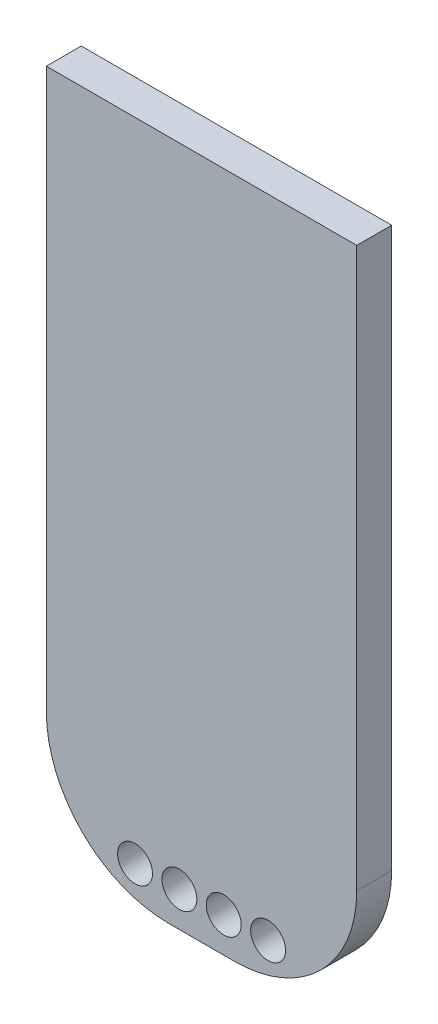
ISO-10303-21;
HEADER;
FILE_DESCRIPTION(('STEP AP214'),'2;1');
FILE_NAME('part.step','',(''),(''),'','','');
FILE_SCHEMA(('AUTOMOTIVE_DESIGN { 1 0 10303 214 1 1 1 1 }'));
ENDSEC;
DATA;
#1=APPLICATION_CONTEXT('core data for automotive mechanical design processes');
#2=APPLICATION_PROTOCOL_DEFINITION('international standard','automotive_design',2000,#1);
#3=PRODUCT_CONTEXT('',#1,'mechanical');
#4=PRODUCT('Part','Part','',(#3));
#5=PRODUCT_RELATED_PRODUCT_CATEGORY('part','',(#4));
#6=PRODUCT_DEFINITION_FORMATION('','',#4);
#7=PRODUCT_DEFINITION_CONTEXT('part definition',#1,'design');
#8=PRODUCT_DEFINITION('design','',#6,#7);
#9=PRODUCT_DEFINITION_SHAPE('','',#8);
#10=(LENGTH_UNIT() NAMED_UNIT(*) SI_UNIT(.MILLI.,.METRE.));
#11=(NAMED_UNIT(*) PLANE_ANGLE_UNIT() SI_UNIT($,.RADIAN.));
#12=(NAMED_UNIT(*) SI_UNIT($,.STERADIAN.) SOLID_ANGLE_UNIT());
#13=UNCERTAINTY_MEASURE_WITH_UNIT(LENGTH_MEASURE(1.E-05),#10,'distance_accuracy_value','');
#14=(GEOMETRIC_REPRESENTATION_CONTEXT(3) GLOBAL_UNCERTAINTY_ASSIGNED_CONTEXT((#13)) GLOBAL_UNIT_ASSIGNED_CONTEXT((#10,
#11,#12)) REPRESENTATION_CONTEXT('',''));
#15=CARTESIAN_POINT('',(0.,0.,0.));
#16=DIRECTION('',(0.,0.,1.));
#17=DIRECTION('',(1.,0.,0.));
#18=AXIS2_PLACEMENT_3D('',#15,#16,#17);
#19=CARTESIAN_POINT('',(0.,39.02,2.));
#20=DIRECTION('',(1.,0.,0.));
#21=DIRECTION('',(0.,1.,0.));
#22=AXIS2_PLACEMENT_3D('',#19,#20,#21);
#23=PLANE('',#22);
#24=DIRECTION('',(0.,-1.,0.));
#25=VECTOR('',#24,1.);
#26=CARTESIAN_POINT('',(0.,39.02,0.));
#27=LINE('',#26,#25);
#28=CARTESIAN_POINT('',(0.,39.02,0.));
#29=VERTEX_POINT('',#28);
#30=CARTESIAN_POINT('',(0.,7.,0.));
#31=VERTEX_POINT('',#30);
#32=EDGE_CURVE('E114',#29,#31,#27,.T.);
#33=ORIENTED_EDGE('',*,*,#32,.T.);
#34=DIRECTION('',(0.,0.,-1.));
#35=VECTOR('',#34,1.);
#36=CARTESIAN_POINT('',(0.,7.,2.));
#37=LINE('',#36,#35);
#38=CARTESIAN_POINT('',(0.,7.,2.));
#39=VERTEX_POINT('',#38);
#40=EDGE_CURVE('E11',#31,#39,#37,.F.);
#41=ORIENTED_EDGE('',*,*,#40,.T.);
#42=DIRECTION('',(0.,-1.,0.));
#43=VECTOR('',#42,1.);
#44=CARTESIAN_POINT('',(0.,39.02,2.));
#45=LINE('',#44,#43);
#46=CARTESIAN_POINT('',(0.,39.02,2.));
#47=VERTEX_POINT('',#46);
#48=EDGE_CURVE('E121',#47,#39,#45,.T.);
#49=ORIENTED_EDGE('',*,*,#48,.F.);
#50=DIRECTION('',(0.,0.,-1.));
#51=VECTOR('',#50,1.);
#52=CARTESIAN_POINT('',(0.,39.02,2.));
#53=LINE('',#52,#51);
#54=EDGE_CURVE('E106',#47,#29,#53,.T.);
#55=ORIENTED_EDGE('',*,*,#54,.T.);
#56=EDGE_LOOP('',(#33,#41,#49,#55));
#57=FACE_BOUND('',#56,.T.);
#58=ADVANCED_FACE('F32',(#57),#23,.F.);
#59=CARTESIAN_POINT('',(0.,0.,2.));
#60=DIRECTION('',(0.,1.,0.));
#61=DIRECTION('',(0.,0.,1.));
#62=AXIS2_PLACEMENT_3D('',#59,#60,#61);
#63=PLANE('',#62);
#64=DIRECTION('',(1.,0.,0.));
#65=VECTOR('',#64,1.);
#66=CARTESIAN_POINT('',(0.,0.,0.));
#67=LINE('',#66,#65);
#68=CARTESIAN_POINT('',(7.,0.,0.));
#69=VERTEX_POINT('',#68);
#70=CARTESIAN_POINT('',(10.78,0.,0.));
#71=VERTEX_POINT('',#70);
#72=EDGE_CURVE('E116',#69,#71,#67,.T.);
#73=ORIENTED_EDGE('',*,*,#72,.T.);
#74=DIRECTION('',(0.,0.,-1.));
#75=VECTOR('',#74,1.);
#76=CARTESIAN_POINT('',(10.78,0.,2.));
#77=LINE('',#76,#75);
#78=CARTESIAN_POINT('',(10.78,0.,2.));
#79=VERTEX_POINT('',#78);
#80=EDGE_CURVE('E53',#71,#79,#77,.F.);
#81=ORIENTED_EDGE('',*,*,#80,.T.);
#82=DIRECTION('',(1.,0.,0.));
#83=VECTOR('',#82,1.);
#84=CARTESIAN_POINT('',(0.,0.,2.));
#85=LINE('',#84,#83);
#86=CARTESIAN_POINT('',(7.,0.,2.));
#87=VERTEX_POINT('',#86);
#88=EDGE_CURVE('E96',#87,#79,#85,.T.);
#89=ORIENTED_EDGE('',*,*,#88,.F.);
#90=DIRECTION('',(0.,0.,-1.));
#91=VECTOR('',#90,1.);
#92=CARTESIAN_POINT('',(7.,0.,2.));
#93=LINE('',#92,#91);
#94=EDGE_CURVE('E143',#87,#69,#93,.T.);
#95=ORIENTED_EDGE('',*,*,#94,.T.);
#96=EDGE_LOOP('',(#73,#81,#89,#95));
#97=FACE_BOUND('',#96,.T.);
#98=ADVANCED_FACE('F151',(#97),#63,.F.);
#99=CARTESIAN_POINT('',(17.78,39.02,2.));
#100=DIRECTION('',(-1.,0.,0.));
#101=DIRECTION('',(0.,-1.,0.));
#102=AXIS2_PLACEMENT_3D('',#99,#100,#101);
#103=PLANE('',#102);
#104=DIRECTION('',(0.,1.,0.));
#105=VECTOR('',#104,1.);
#106=CARTESIAN_POINT('',(17.78,39.02,2.));
#107=LINE('',#106,#105);
#108=CARTESIAN_POINT('',(17.78,7.,2.));
#109=VERTEX_POINT('',#108);
#110=CARTESIAN_POINT('',(17.78,39.02,2.));
#111=VERTEX_POINT('',#110);
#112=EDGE_CURVE('E86',#109,#111,#107,.T.);
#113=ORIENTED_EDGE('',*,*,#112,.F.);
#114=DIRECTION('',(0.,0.,-1.));
#115=VECTOR('',#114,1.);
#116=CARTESIAN_POINT('',(17.78,7.,2.));
#117=LINE('',#116,#115);
#118=CARTESIAN_POINT('',(17.78,7.,0.));
#119=VERTEX_POINT('',#118);
#120=EDGE_CURVE('E105',#109,#119,#117,.T.);
#121=ORIENTED_EDGE('',*,*,#120,.T.);
#122=DIRECTION('',(0.,1.,0.));
#123=VECTOR('',#122,1.);
#124=CARTESIAN_POINT('',(17.78,39.02,0.));
#125=LINE('',#124,#123);
#126=CARTESIAN_POINT('',(17.78,39.02,0.));
#127=VERTEX_POINT('',#126);
#128=EDGE_CURVE('E102',#119,#127,#125,.T.);
#129=ORIENTED_EDGE('',*,*,#128,.T.);
#130=DIRECTION('',(0.,0.,-1.));
#131=VECTOR('',#130,1.);
#132=CARTESIAN_POINT('',(17.78,39.02,2.));
#133=LINE('',#132,#131);
#134=EDGE_CURVE('E99',#111,#127,#133,.T.);
#135=ORIENTED_EDGE('',*,*,#134,.F.);
#136=EDGE_LOOP('',(#113,#121,#129,#135));
#137=FACE_BOUND('',#136,.T.);
#138=ADVANCED_FACE('F100',(#137),#103,.F.);
#139=CARTESIAN_POINT('',(0.,39.02,2.));
#140=DIRECTION('',(0.,-1.,0.));
#141=DIRECTION('',(0.,0.,-1.));
#142=AXIS2_PLACEMENT_3D('',#139,#140,#141);
#143=PLANE('',#142);
#144=DIRECTION('',(-1.,0.,0.));
#145=VECTOR('',#144,1.);
#146=CARTESIAN_POINT('',(0.,39.02,0.));
#147=LINE('',#146,#145);
#148=EDGE_CURVE('E120',#127,#29,#147,.T.);
#149=ORIENTED_EDGE('',*,*,#148,.T.);
#150=ORIENTED_EDGE('',*,*,#54,.F.);
#151=DIRECTION('',(-1.,0.,0.));
#152=VECTOR('',#151,1.);
#153=CARTESIAN_POINT('',(0.,39.02,2.));
#154=LINE('',#153,#152);
#155=EDGE_CURVE('E90',#111,#47,#154,.T.);
#156=ORIENTED_EDGE('',*,*,#155,.F.);
#157=ORIENTED_EDGE('',*,*,#134,.T.);
#158=EDGE_LOOP('',(#149,#150,#156,#157));
#159=FACE_BOUND('',#158,.T.);
#160=ADVANCED_FACE('F108',(#159),#143,.F.);
#161=CARTESIAN_POINT('',(0.,0.,2.));
#162=DIRECTION('',(0.,0.,1.));
#163=DIRECTION('',(1.,0.,0.));
#164=AXIS2_PLACEMENT_3D('',#161,#162,#163);
#165=PLANE('',#164);
#166=CARTESIAN_POINT('',(12.7012919632041,2.,2.));
#167=DIRECTION('',(0.,0.,1.));
#168=DIRECTION('',(1.,0.,0.));
#169=AXIS2_PLACEMENT_3D('',#166,#167,#168);
#170=CIRCLE('',#169,1.);
#171=CARTESIAN_POINT('',(13.7012919632041,2.,2.));
#172=VERTEX_POINT('',#171);
#173=EDGE_CURVE('E137',#172,#172,#170,.T.);
#174=ORIENTED_EDGE('',*,*,#173,.F.);
#175=EDGE_LOOP('',(#174));
#176=FACE_BOUND('',#175,.T.);
#177=CARTESIAN_POINT('',(10.1612919632041,2.,2.));
#178=DIRECTION('',(0.,0.,1.));
#179=DIRECTION('',(1.,0.,0.));
#180=AXIS2_PLACEMENT_3D('',#177,#178,#179);
#181=CIRCLE('',#180,1.);
#182=CARTESIAN_POINT('',(11.1612919632041,2.,2.));
#183=VERTEX_POINT('',#182);
#184=EDGE_CURVE('E133',#183,#183,#181,.T.);
#185=ORIENTED_EDGE('',*,*,#184,.F.);
#186=EDGE_LOOP('',(#185));
#187=FACE_BOUND('',#186,.T.);
#188=CARTESIAN_POINT('',(7.62129196320414,2.,2.));
#189=DIRECTION('',(0.,0.,1.));
#190=DIRECTION('',(1.,0.,0.));
#191=AXIS2_PLACEMENT_3D('',#188,#189,#190);
#192=CIRCLE('',#191,1.);
#193=CARTESIAN_POINT('',(8.62129196320414,2.,2.));
#194=VERTEX_POINT('',#193);
#195=EDGE_CURVE('E129',#194,#194,#192,.T.);
#196=ORIENTED_EDGE('',*,*,#195,.F.);
#197=EDGE_LOOP('',(#196));
#198=FACE_BOUND('',#197,.T.);
#199=CARTESIAN_POINT('',(5.08129196320414,2.,2.));
#200=DIRECTION('',(0.,0.,1.));
#201=DIRECTION('',(1.,0.,0.));
#202=AXIS2_PLACEMENT_3D('',#199,#200,#201);
#203=CIRCLE('',#202,1.);
#204=CARTESIAN_POINT('',(6.08129196320414,2.,2.));
#205=VERTEX_POINT('',#204);
#206=EDGE_CURVE('E125',#205,#205,#203,.T.);
#207=ORIENTED_EDGE('',*,*,#206,.F.);
#208=EDGE_LOOP('',(#207));
#209=FACE_BOUND('',#208,.T.);
#210=ORIENTED_EDGE('',*,*,#88,.T.);
#211=CARTESIAN_POINT('',(10.78,7.,2.));
#212=DIRECTION('',(0.,0.,1.));
#213=DIRECTION('',(1.,0.,0.));
#214=AXIS2_PLACEMENT_3D('',#211,#212,#213);
#215=CIRCLE('',#214,7.);
#216=EDGE_CURVE('E40',#79,#109,#215,.T.);
#217=ORIENTED_EDGE('',*,*,#216,.T.);
#218=ORIENTED_EDGE('',*,*,#112,.T.);
#219=ORIENTED_EDGE('',*,*,#155,.T.);
#220=ORIENTED_EDGE('',*,*,#48,.T.);
#221=CARTESIAN_POINT('',(7.,7.,2.));
#222=DIRECTION('',(0.,0.,1.));
#223=DIRECTION('',(1.,0.,0.));
#224=AXIS2_PLACEMENT_3D('',#221,#222,#223);
#225=CIRCLE('',#224,7.);
#226=EDGE_CURVE('E147',#39,#87,#225,.T.);
#227=ORIENTED_EDGE('',*,*,#226,.T.);
#228=EDGE_LOOP('',(#210,#217,#218,#219,#220,#227));
#229=FACE_BOUND('',#228,.T.);
#230=ADVANCED_FACE('F88',(#176,#187,#198,#209,#229),#165,.T.);
#231=CARTESIAN_POINT('',(0.,0.,0.));
#232=DIRECTION('',(0.,0.,1.));
#233=DIRECTION('',(1.,0.,0.));
#234=AXIS2_PLACEMENT_3D('',#231,#232,#233);
#235=PLANE('',#234);
#236=CARTESIAN_POINT('',(12.7012919632041,2.,0.));
#237=DIRECTION('',(0.,0.,1.));
#238=DIRECTION('',(1.,0.,0.));
#239=AXIS2_PLACEMENT_3D('',#236,#237,#238);
#240=CIRCLE('',#239,1.);
#241=CARTESIAN_POINT('',(13.7012919632041,2.,0.));
#242=VERTEX_POINT('',#241);
#243=EDGE_CURVE('E134',#242,#242,#240,.T.);
#244=ORIENTED_EDGE('',*,*,#243,.T.);
#245=EDGE_LOOP('',(#244));
#246=FACE_BOUND('',#245,.T.);
#247=CARTESIAN_POINT('',(10.1612919632041,2.,0.));
#248=DIRECTION('',(0.,0.,1.));
#249=DIRECTION('',(1.,0.,0.));
#250=AXIS2_PLACEMENT_3D('',#247,#248,#249);
#251=CIRCLE('',#250,1.);
#252=CARTESIAN_POINT('',(11.1612919632041,2.,0.));
#253=VERTEX_POINT('',#252);
#254=EDGE_CURVE('E130',#253,#253,#251,.T.);
#255=ORIENTED_EDGE('',*,*,#254,.T.);
#256=EDGE_LOOP('',(#255));
#257=FACE_BOUND('',#256,.T.);
#258=CARTESIAN_POINT('',(7.62129196320414,2.,0.));
#259=DIRECTION('',(0.,0.,1.));
#260=DIRECTION('',(1.,0.,0.));
#261=AXIS2_PLACEMENT_3D('',#258,#259,#260);
#262=CIRCLE('',#261,1.);
#263=CARTESIAN_POINT('',(8.62129196320414,2.,0.));
#264=VERTEX_POINT('',#263);
#265=EDGE_CURVE('E126',#264,#264,#262,.T.);
#266=ORIENTED_EDGE('',*,*,#265,.T.);
#267=EDGE_LOOP('',(#266));
#268=FACE_BOUND('',#267,.T.);
#269=CARTESIAN_POINT('',(5.08129196320414,2.,0.));
#270=DIRECTION('',(0.,0.,1.));
#271=DIRECTION('',(1.,0.,0.));
#272=AXIS2_PLACEMENT_3D('',#269,#270,#271);
#273=CIRCLE('',#272,1.);
#274=CARTESIAN_POINT('',(6.08129196320414,2.,0.));
#275=VERTEX_POINT('',#274);
#276=EDGE_CURVE('E117',#275,#275,#273,.T.);
#277=ORIENTED_EDGE('',*,*,#276,.T.);
#278=EDGE_LOOP('',(#277));
#279=FACE_BOUND('',#278,.T.);
#280=ORIENTED_EDGE('',*,*,#128,.F.);
#281=CARTESIAN_POINT('',(10.78,7.,0.));
#282=DIRECTION('',(0.,0.,1.));
#283=DIRECTION('',(1.,0.,0.));
#284=AXIS2_PLACEMENT_3D('',#281,#282,#283);
#285=CIRCLE('',#284,7.);
#286=EDGE_CURVE('E141',#119,#71,#285,.F.);
#287=ORIENTED_EDGE('',*,*,#286,.T.);
#288=ORIENTED_EDGE('',*,*,#72,.F.);
#289=CARTESIAN_POINT('',(7.,7.,0.));
#290=DIRECTION('',(0.,0.,1.));
#291=DIRECTION('',(1.,0.,0.));
#292=AXIS2_PLACEMENT_3D('',#289,#290,#291);
#293=CIRCLE('',#292,7.);
#294=EDGE_CURVE('E139',#69,#31,#293,.F.);
#295=ORIENTED_EDGE('',*,*,#294,.T.);
#296=ORIENTED_EDGE('',*,*,#32,.F.);
#297=ORIENTED_EDGE('',*,*,#148,.F.);
#298=EDGE_LOOP('',(#280,#287,#288,#295,#296,#297));
#299=FACE_BOUND('',#298,.T.);
#300=ADVANCED_FACE('F155',(#246,#257,#268,#279,#299),#235,.F.);
#301=CARTESIAN_POINT('',(5.08129196320414,2.,-8.));
#302=DIRECTION('',(0.,0.,1.));
#303=DIRECTION('',(1.,0.,0.));
#304=AXIS2_PLACEMENT_3D('',#301,#302,#303);
#305=CYLINDRICAL_SURFACE('',#304,1.);
#306=ORIENTED_EDGE('',*,*,#206,.T.);
#307=EDGE_LOOP('',(#306));
#308=FACE_BOUND('',#307,.T.);
#309=ORIENTED_EDGE('',*,*,#276,.F.);
#310=EDGE_LOOP('',(#309));
#311=FACE_BOUND('',#310,.T.);
#312=ADVANCED_FACE('F179',(#308,#311),#305,.F.);
#313=CARTESIAN_POINT('',(7.62129196320414,2.,-8.));
#314=DIRECTION('',(0.,0.,1.));
#315=DIRECTION('',(1.,0.,0.));
#316=AXIS2_PLACEMENT_3D('',#313,#314,#315);
#317=CYLINDRICAL_SURFACE('',#316,1.);
#318=ORIENTED_EDGE('',*,*,#195,.T.);
#319=EDGE_LOOP('',(#318));
#320=FACE_BOUND('',#319,.T.);
#321=ORIENTED_EDGE('',*,*,#265,.F.);
#322=EDGE_LOOP('',(#321));
#323=FACE_BOUND('',#322,.T.);
#324=ADVANCED_FACE('F182',(#320,#323),#317,.F.);
#325=CARTESIAN_POINT('',(10.1612919632041,2.,-8.));
#326=DIRECTION('',(0.,0.,1.));
#327=DIRECTION('',(1.,0.,0.));
#328=AXIS2_PLACEMENT_3D('',#325,#326,#327);
#329=CYLINDRICAL_SURFACE('',#328,1.);
#330=ORIENTED_EDGE('',*,*,#184,.T.);
#331=EDGE_LOOP('',(#330));
#332=FACE_BOUND('',#331,.T.);
#333=ORIENTED_EDGE('',*,*,#254,.F.);
#334=EDGE_LOOP('',(#333));
#335=FACE_BOUND('',#334,.T.);
#336=ADVANCED_FACE('F207',(#332,#335),#329,.F.);
#337=CARTESIAN_POINT('',(12.7012919632041,2.,-8.));
#338=DIRECTION('',(0.,0.,1.));
#339=DIRECTION('',(1.,0.,0.));
#340=AXIS2_PLACEMENT_3D('',#337,#338,#339);
#341=CYLINDRICAL_SURFACE('',#340,1.);
#342=ORIENTED_EDGE('',*,*,#173,.T.);
#343=EDGE_LOOP('',(#342));
#344=FACE_BOUND('',#343,.T.);
#345=ORIENTED_EDGE('',*,*,#243,.F.);
#346=EDGE_LOOP('',(#345));
#347=FACE_BOUND('',#346,.T.);
#348=ADVANCED_FACE('F167',(#344,#347),#341,.F.);
#349=CARTESIAN_POINT('',(10.78,7.,2.));
#350=DIRECTION('',(0.,0.,-1.));
#351=DIRECTION('',(-1.,0.,0.));
#352=AXIS2_PLACEMENT_3D('',#349,#350,#351);
#353=CYLINDRICAL_SURFACE('',#352,7.);
#354=ORIENTED_EDGE('',*,*,#216,.F.);
#355=ORIENTED_EDGE('',*,*,#80,.F.);
#356=ORIENTED_EDGE('',*,*,#286,.F.);
#357=ORIENTED_EDGE('',*,*,#120,.F.);
#358=EDGE_LOOP('',(#354,#355,#356,#357));
#359=FACE_BOUND('',#358,.T.);
#360=ADVANCED_FACE('F200',(#359),#353,.T.);
#361=CARTESIAN_POINT('',(7.,7.,2.));
#362=DIRECTION('',(0.,0.,-1.));
#363=DIRECTION('',(-1.,0.,0.));
#364=AXIS2_PLACEMENT_3D('',#361,#362,#363);
#365=CYLINDRICAL_SURFACE('',#364,7.);
#366=ORIENTED_EDGE('',*,*,#226,.F.);
#367=ORIENTED_EDGE('',*,*,#40,.F.);
#368=ORIENTED_EDGE('',*,*,#294,.F.);
#369=ORIENTED_EDGE('',*,*,#94,.F.);
#370=EDGE_LOOP('',(#366,#367,#368,#369));
#371=FACE_BOUND('',#370,.T.);
#372=ADVANCED_FACE('F34',(#371),#365,.T.);
#373=CLOSED_SHELL('',(#58,#98,#138,#160,#230,#300,#312,#324,#336,#348,#360,#372));
#374=MANIFOLD_SOLID_BREP('B2',#373);
#375=ADVANCED_BREP_SHAPE_REPRESENTATION('',(#18,#374),#14);
#376=SHAPE_DEFINITION_REPRESENTATION(#9,#375);
ENDSEC;
END-ISO-10303-21;
